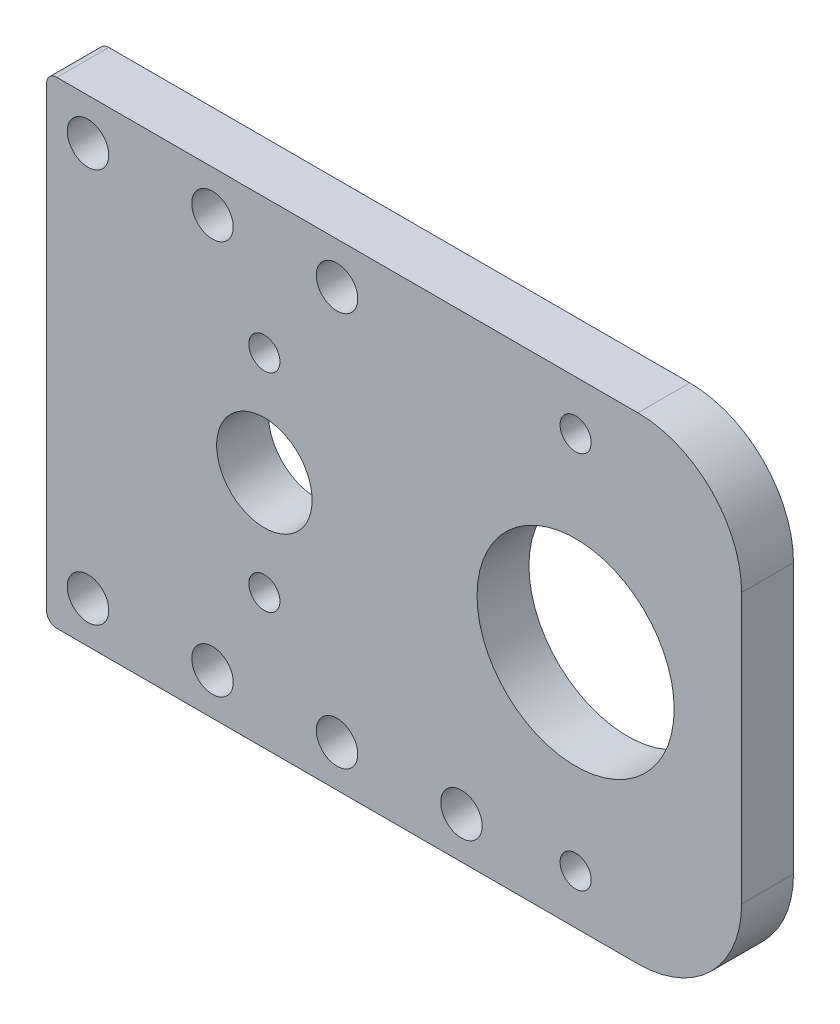
ISO-10303-21;
HEADER;
FILE_DESCRIPTION(('STEP AP214'),'2;1');
FILE_NAME('part.step','',(''),(''),'','','');
FILE_SCHEMA(('AUTOMOTIVE_DESIGN { 1 0 10303 214 1 1 1 1 }'));
ENDSEC;
DATA;
#1=APPLICATION_CONTEXT('core data for automotive mechanical design processes');
#2=APPLICATION_PROTOCOL_DEFINITION('international standard','automotive_design',2000,#1);
#3=PRODUCT_CONTEXT('',#1,'mechanical');
#4=PRODUCT('Part','Part','',(#3));
#5=PRODUCT_RELATED_PRODUCT_CATEGORY('part','',(#4));
#6=PRODUCT_DEFINITION_FORMATION('','',#4);
#7=PRODUCT_DEFINITION_CONTEXT('part definition',#1,'design');
#8=PRODUCT_DEFINITION('design','',#6,#7);
#9=PRODUCT_DEFINITION_SHAPE('','',#8);
#10=(LENGTH_UNIT() NAMED_UNIT(*) SI_UNIT(.MILLI.,.METRE.));
#11=(NAMED_UNIT(*) PLANE_ANGLE_UNIT() SI_UNIT($,.RADIAN.));
#12=(NAMED_UNIT(*) SI_UNIT($,.STERADIAN.) SOLID_ANGLE_UNIT());
#13=UNCERTAINTY_MEASURE_WITH_UNIT(LENGTH_MEASURE(1.E-05),#10,'distance_accuracy_value','');
#14=(GEOMETRIC_REPRESENTATION_CONTEXT(3) GLOBAL_UNCERTAINTY_ASSIGNED_CONTEXT((#13)) GLOBAL_UNIT_ASSIGNED_CONTEXT((#10,
#11,#12)) REPRESENTATION_CONTEXT('',''));
#15=CARTESIAN_POINT('',(0.,0.,0.));
#16=DIRECTION('',(0.,0.,1.));
#17=DIRECTION('',(1.,0.,0.));
#18=AXIS2_PLACEMENT_3D('',#15,#16,#17);
#19=CARTESIAN_POINT('',(0.,0.,5.));
#20=DIRECTION('',(0.,0.,1.));
#21=DIRECTION('',(1.,0.,0.));
#22=AXIS2_PLACEMENT_3D('',#19,#20,#21);
#23=PLANE('',#22);
#24=CARTESIAN_POINT('',(19.,-18.9999999999999,5.));
#25=DIRECTION('',(0.,0.,1.));
#26=DIRECTION('',(1.,0.,0.));
#27=AXIS2_PLACEMENT_3D('',#24,#25,#26);
#28=CIRCLE('',#27,2.);
#29=CARTESIAN_POINT('',(21.,-18.9999999999999,5.));
#30=VERTEX_POINT('',#29);
#31=EDGE_CURVE('E357',#30,#30,#28,.T.);
#32=ORIENTED_EDGE('',*,*,#31,.F.);
#33=EDGE_LOOP('',(#32));
#34=FACE_BOUND('',#33,.T.);
#35=CARTESIAN_POINT('',(7.00000000000001,18.9999999999999,5.));
#36=DIRECTION('',(0.,0.,1.));
#37=DIRECTION('',(1.,0.,0.));
#38=AXIS2_PLACEMENT_3D('',#35,#36,#37);
#39=CIRCLE('',#38,2.);
#40=CARTESIAN_POINT('',(9.00000000000001,18.9999999999999,5.));
#41=VERTEX_POINT('',#40);
#42=EDGE_CURVE('E183',#41,#41,#39,.F.);
#43=ORIENTED_EDGE('',*,*,#42,.T.);
#44=EDGE_LOOP('',(#43));
#45=FACE_BOUND('',#44,.T.);
#46=CARTESIAN_POINT('',(-4.99999999999999,-18.9999999999999,5.));
#47=DIRECTION('',(0.,0.,1.));
#48=DIRECTION('',(1.,0.,0.));
#49=AXIS2_PLACEMENT_3D('',#46,#47,#48);
#50=CIRCLE('',#49,2.);
#51=CARTESIAN_POINT('',(-2.99999999999999,-18.9999999999999,5.));
#52=VERTEX_POINT('',#51);
#53=EDGE_CURVE('E176',#52,#52,#50,.F.);
#54=ORIENTED_EDGE('',*,*,#53,.T.);
#55=EDGE_LOOP('',(#54));
#56=FACE_BOUND('',#55,.T.);
#57=CARTESIAN_POINT('',(-17.,-18.9999999999999,5.));
#58=DIRECTION('',(0.,0.,1.));
#59=DIRECTION('',(1.,0.,0.));
#60=AXIS2_PLACEMENT_3D('',#57,#58,#59);
#61=CIRCLE('',#60,2.);
#62=CARTESIAN_POINT('',(-15.,-18.9999999999999,5.));
#63=VERTEX_POINT('',#62);
#64=EDGE_CURVE('E179',#63,#63,#61,.F.);
#65=ORIENTED_EDGE('',*,*,#64,.T.);
#66=EDGE_LOOP('',(#65));
#67=FACE_BOUND('',#66,.T.);
#68=CARTESIAN_POINT('',(30.,18.25,5.));
#69=DIRECTION('',(0.,0.,1.));
#70=DIRECTION('',(1.,0.,0.));
#71=AXIS2_PLACEMENT_3D('',#68,#69,#70);
#72=CIRCLE('',#71,1.5);
#73=CARTESIAN_POINT('',(31.5,18.25,5.));
#74=VERTEX_POINT('',#73);
#75=EDGE_CURVE('E194',#74,#74,#72,.T.);
#76=ORIENTED_EDGE('',*,*,#75,.F.);
#77=EDGE_LOOP('',(#76));
#78=FACE_BOUND('',#77,.T.);
#79=CARTESIAN_POINT('',(0.,-9.99999999999999,5.));
#80=DIRECTION('',(0.,0.,1.));
#81=DIRECTION('',(1.,0.,0.));
#82=AXIS2_PLACEMENT_3D('',#79,#80,#81);
#83=CIRCLE('',#82,1.5);
#84=CARTESIAN_POINT('',(1.50000000000002,-9.99999999999999,5.));
#85=VERTEX_POINT('',#84);
#86=EDGE_CURVE('E197',#85,#85,#83,.T.);
#87=ORIENTED_EDGE('',*,*,#86,.F.);
#88=EDGE_LOOP('',(#87));
#89=FACE_BOUND('',#88,.T.);
#90=CARTESIAN_POINT('',(30.,-18.25,5.));
#91=DIRECTION('',(0.,0.,1.));
#92=DIRECTION('',(1.,0.,0.));
#93=AXIS2_PLACEMENT_3D('',#90,#91,#92);
#94=CIRCLE('',#93,1.5);
#95=CARTESIAN_POINT('',(31.5,-18.25,5.));
#96=VERTEX_POINT('',#95);
#97=EDGE_CURVE('E201',#96,#96,#94,.F.);
#98=ORIENTED_EDGE('',*,*,#97,.T.);
#99=EDGE_LOOP('',(#98));
#100=FACE_BOUND('',#99,.T.);
#101=CARTESIAN_POINT('',(30.,0.,5.));
#102=DIRECTION('',(0.,0.,1.));
#103=DIRECTION('',(1.,0.,0.));
#104=AXIS2_PLACEMENT_3D('',#101,#102,#103);
#105=CIRCLE('',#104,9.5);
#106=CARTESIAN_POINT('',(39.5,0.,5.));
#107=VERTEX_POINT('',#106);
#108=EDGE_CURVE('E204',#107,#107,#105,.T.);
#109=ORIENTED_EDGE('',*,*,#108,.F.);
#110=EDGE_LOOP('',(#109));
#111=FACE_BOUND('',#110,.T.);
#112=CARTESIAN_POINT('',(0.,0.,5.));
#113=DIRECTION('',(0.,0.,1.));
#114=DIRECTION('',(1.,0.,0.));
#115=AXIS2_PLACEMENT_3D('',#112,#113,#114);
#116=CIRCLE('',#115,4.6);
#117=CARTESIAN_POINT('',(4.6,0.,5.));
#118=VERTEX_POINT('',#117);
#119=EDGE_CURVE('E210',#118,#118,#116,.T.);
#120=ORIENTED_EDGE('',*,*,#119,.F.);
#121=EDGE_LOOP('',(#120));
#122=FACE_BOUND('',#121,.T.);
#123=CARTESIAN_POINT('',(0.,9.99999999999999,5.));
#124=DIRECTION('',(0.,0.,1.));
#125=DIRECTION('',(1.,0.,0.));
#126=AXIS2_PLACEMENT_3D('',#123,#124,#125);
#127=CIRCLE('',#126,1.5);
#128=CARTESIAN_POINT('',(1.50000000000002,9.99999999999999,5.));
#129=VERTEX_POINT('',#128);
#130=EDGE_CURVE('E114',#129,#129,#127,.F.);
#131=ORIENTED_EDGE('',*,*,#130,.T.);
#132=EDGE_LOOP('',(#131));
#133=FACE_BOUND('',#132,.T.);
#134=CARTESIAN_POINT('',(7.00000000000001,-18.9999999999999,5.));
#135=DIRECTION('',(0.,0.,1.));
#136=DIRECTION('',(1.,0.,0.));
#137=AXIS2_PLACEMENT_3D('',#134,#135,#136);
#138=CIRCLE('',#137,2.);
#139=CARTESIAN_POINT('',(9.00000000000001,-18.9999999999999,5.));
#140=VERTEX_POINT('',#139);
#141=EDGE_CURVE('E180',#140,#140,#138,.T.);
#142=ORIENTED_EDGE('',*,*,#141,.F.);
#143=EDGE_LOOP('',(#142));
#144=FACE_BOUND('',#143,.T.);
#145=CARTESIAN_POINT('',(-4.99999999999999,18.9999999999999,5.));
#146=DIRECTION('',(0.,0.,1.));
#147=DIRECTION('',(1.,0.,0.));
#148=AXIS2_PLACEMENT_3D('',#145,#146,#147);
#149=CIRCLE('',#148,2.);
#150=CARTESIAN_POINT('',(-2.99999999999999,18.9999999999999,5.));
#151=VERTEX_POINT('',#150);
#152=EDGE_CURVE('E186',#151,#151,#149,.T.);
#153=ORIENTED_EDGE('',*,*,#152,.F.);
#154=EDGE_LOOP('',(#153));
#155=FACE_BOUND('',#154,.T.);
#156=CARTESIAN_POINT('',(-17.,18.9999999999999,5.));
#157=DIRECTION('',(0.,0.,1.));
#158=DIRECTION('',(1.,0.,0.));
#159=AXIS2_PLACEMENT_3D('',#156,#157,#158);
#160=CIRCLE('',#159,2.);
#161=CARTESIAN_POINT('',(-15.,18.9999999999999,5.));
#162=VERTEX_POINT('',#161);
#163=EDGE_CURVE('E172',#162,#162,#160,.T.);
#164=ORIENTED_EDGE('',*,*,#163,.F.);
#165=EDGE_LOOP('',(#164));
#166=FACE_BOUND('',#165,.T.);
#167=DIRECTION('',(-1.,0.,0.));
#168=VECTOR('',#167,1.);
#169=CARTESIAN_POINT('',(0.,23.,5.));
#170=LINE('',#169,#168);
#171=CARTESIAN_POINT('',(36.,23.,5.));
#172=VERTEX_POINT('',#171);
#173=CARTESIAN_POINT('',(-20.,23.,5.));
#174=VERTEX_POINT('',#173);
#175=EDGE_CURVE('E167',#172,#174,#170,.T.);
#176=ORIENTED_EDGE('',*,*,#175,.T.);
#177=CARTESIAN_POINT('',(-20.,22.,5.));
#178=DIRECTION('',(0.,0.,1.));
#179=DIRECTION('',(1.,0.,0.));
#180=AXIS2_PLACEMENT_3D('',#177,#178,#179);
#181=CIRCLE('',#180,1.);
#182=CARTESIAN_POINT('',(-21.,22.,5.));
#183=VERTEX_POINT('',#182);
#184=EDGE_CURVE('E140',#174,#183,#181,.T.);
#185=ORIENTED_EDGE('',*,*,#184,.T.);
#186=DIRECTION('',(0.,-1.,0.));
#187=VECTOR('',#186,1.);
#188=CARTESIAN_POINT('',(-21.,0.,5.));
#189=LINE('',#188,#187);
#190=CARTESIAN_POINT('',(-21.,-22.,5.));
#191=VERTEX_POINT('',#190);
#192=EDGE_CURVE('E121',#183,#191,#189,.T.);
#193=ORIENTED_EDGE('',*,*,#192,.T.);
#194=CARTESIAN_POINT('',(-20.,-22.,5.));
#195=DIRECTION('',(0.,0.,1.));
#196=DIRECTION('',(1.,0.,0.));
#197=AXIS2_PLACEMENT_3D('',#194,#195,#196);
#198=CIRCLE('',#197,1.);
#199=CARTESIAN_POINT('',(-20.,-23.,5.));
#200=VERTEX_POINT('',#199);
#201=EDGE_CURVE('E138',#191,#200,#198,.T.);
#202=ORIENTED_EDGE('',*,*,#201,.T.);
#203=DIRECTION('',(-1.,0.,0.));
#204=VECTOR('',#203,1.);
#205=CARTESIAN_POINT('',(0.,-23.,5.));
#206=LINE('',#205,#204);
#207=CARTESIAN_POINT('',(36.,-23.,5.));
#208=VERTEX_POINT('',#207);
#209=EDGE_CURVE('E208',#208,#200,#206,.T.);
#210=ORIENTED_EDGE('',*,*,#209,.F.);
#211=CARTESIAN_POINT('',(36.,-13.,5.));
#212=DIRECTION('',(0.,0.,1.));
#213=DIRECTION('',(1.,0.,0.));
#214=AXIS2_PLACEMENT_3D('',#211,#212,#213);
#215=CIRCLE('',#214,10.);
#216=CARTESIAN_POINT('',(46.,-13.,5.));
#217=VERTEX_POINT('',#216);
#218=EDGE_CURVE('E250',#208,#217,#215,.T.);
#219=ORIENTED_EDGE('',*,*,#218,.T.);
#220=DIRECTION('',(0.,-1.,0.));
#221=VECTOR('',#220,1.);
#222=CARTESIAN_POINT('',(46.,0.,5.));
#223=LINE('',#222,#221);
#224=CARTESIAN_POINT('',(46.,13.,5.));
#225=VERTEX_POINT('',#224);
#226=EDGE_CURVE('E110',#225,#217,#223,.T.);
#227=ORIENTED_EDGE('',*,*,#226,.F.);
#228=CARTESIAN_POINT('',(36.,13.,5.));
#229=DIRECTION('',(0.,0.,1.));
#230=DIRECTION('',(1.,0.,0.));
#231=AXIS2_PLACEMENT_3D('',#228,#229,#230);
#232=CIRCLE('',#231,10.);
#233=EDGE_CURVE('E130',#225,#172,#232,.T.);
#234=ORIENTED_EDGE('',*,*,#233,.T.);
#235=EDGE_LOOP('',(#176,#185,#193,#202,#210,#219,#227,#234));
#236=FACE_BOUND('',#235,.T.);
#237=ADVANCED_FACE('F35',(#34,#45,#56,#67,#78,#89,#100,#111,#122,#133,#144,#155,#166,#236),#23,.T.);
#238=CARTESIAN_POINT('',(0.,0.,0.));
#239=DIRECTION('',(0.,0.,1.));
#240=DIRECTION('',(1.,0.,0.));
#241=AXIS2_PLACEMENT_3D('',#238,#239,#240);
#242=PLANE('',#241);
#243=CARTESIAN_POINT('',(19.,-18.9999999999999,0.));
#244=DIRECTION('',(0.,0.,1.));
#245=DIRECTION('',(1.,0.,0.));
#246=AXIS2_PLACEMENT_3D('',#243,#244,#245);
#247=CIRCLE('',#246,2.);
#248=CARTESIAN_POINT('',(21.,-18.9999999999999,0.));
#249=VERTEX_POINT('',#248);
#250=EDGE_CURVE('E39',#249,#249,#247,.T.);
#251=ORIENTED_EDGE('',*,*,#250,.T.);
#252=EDGE_LOOP('',(#251));
#253=FACE_BOUND('',#252,.T.);
#254=CARTESIAN_POINT('',(-17.,18.9999999999999,0.));
#255=DIRECTION('',(0.,0.,1.));
#256=DIRECTION('',(1.,0.,0.));
#257=AXIS2_PLACEMENT_3D('',#254,#255,#256);
#258=CIRCLE('',#257,2.);
#259=CARTESIAN_POINT('',(-15.,18.9999999999999,0.));
#260=VERTEX_POINT('',#259);
#261=EDGE_CURVE('E219',#260,#260,#258,.T.);
#262=ORIENTED_EDGE('',*,*,#261,.T.);
#263=EDGE_LOOP('',(#262));
#264=FACE_BOUND('',#263,.T.);
#265=CARTESIAN_POINT('',(7.00000000000001,-18.9999999999999,0.));
#266=DIRECTION('',(0.,0.,1.));
#267=DIRECTION('',(1.,0.,0.));
#268=AXIS2_PLACEMENT_3D('',#265,#266,#267);
#269=CIRCLE('',#268,2.);
#270=CARTESIAN_POINT('',(9.00000000000001,-18.9999999999999,0.));
#271=VERTEX_POINT('',#270);
#272=EDGE_CURVE('E238',#271,#271,#269,.T.);
#273=ORIENTED_EDGE('',*,*,#272,.T.);
#274=EDGE_LOOP('',(#273));
#275=FACE_BOUND('',#274,.T.);
#276=CARTESIAN_POINT('',(-4.99999999999999,-18.9999999999999,0.));
#277=DIRECTION('',(0.,0.,1.));
#278=DIRECTION('',(1.,0.,0.));
#279=AXIS2_PLACEMENT_3D('',#276,#277,#278);
#280=CIRCLE('',#279,2.);
#281=CARTESIAN_POINT('',(-2.99999999999999,-18.9999999999999,0.));
#282=VERTEX_POINT('',#281);
#283=EDGE_CURVE('E235',#282,#282,#280,.F.);
#284=ORIENTED_EDGE('',*,*,#283,.F.);
#285=EDGE_LOOP('',(#284));
#286=FACE_BOUND('',#285,.T.);
#287=CARTESIAN_POINT('',(-17.,-18.9999999999999,0.));
#288=DIRECTION('',(0.,0.,1.));
#289=DIRECTION('',(1.,0.,0.));
#290=AXIS2_PLACEMENT_3D('',#287,#288,#289);
#291=CIRCLE('',#290,2.);
#292=CARTESIAN_POINT('',(-15.,-18.9999999999999,0.));
#293=VERTEX_POINT('',#292);
#294=EDGE_CURVE('E193',#293,#293,#291,.F.);
#295=ORIENTED_EDGE('',*,*,#294,.F.);
#296=EDGE_LOOP('',(#295));
#297=FACE_BOUND('',#296,.T.);
#298=CARTESIAN_POINT('',(30.,18.25,0.));
#299=DIRECTION('',(0.,0.,1.));
#300=DIRECTION('',(1.,0.,0.));
#301=AXIS2_PLACEMENT_3D('',#298,#299,#300);
#302=CIRCLE('',#301,1.5);
#303=CARTESIAN_POINT('',(31.5,18.25,0.));
#304=VERTEX_POINT('',#303);
#305=EDGE_CURVE('E215',#304,#304,#302,.T.);
#306=ORIENTED_EDGE('',*,*,#305,.T.);
#307=EDGE_LOOP('',(#306));
#308=FACE_BOUND('',#307,.T.);
#309=CARTESIAN_POINT('',(0.,-9.99999999999999,0.));
#310=DIRECTION('',(0.,0.,1.));
#311=DIRECTION('',(1.,0.,0.));
#312=AXIS2_PLACEMENT_3D('',#309,#310,#311);
#313=CIRCLE('',#312,1.5);
#314=CARTESIAN_POINT('',(1.50000000000002,-9.99999999999999,0.));
#315=VERTEX_POINT('',#314);
#316=EDGE_CURVE('E218',#315,#315,#313,.T.);
#317=ORIENTED_EDGE('',*,*,#316,.T.);
#318=EDGE_LOOP('',(#317));
#319=FACE_BOUND('',#318,.T.);
#320=CARTESIAN_POINT('',(30.,-18.25,0.));
#321=DIRECTION('',(0.,0.,1.));
#322=DIRECTION('',(1.,0.,0.));
#323=AXIS2_PLACEMENT_3D('',#320,#321,#322);
#324=CIRCLE('',#323,1.5);
#325=CARTESIAN_POINT('',(31.5,-18.25,0.));
#326=VERTEX_POINT('',#325);
#327=EDGE_CURVE('E222',#326,#326,#324,.F.);
#328=ORIENTED_EDGE('',*,*,#327,.F.);
#329=EDGE_LOOP('',(#328));
#330=FACE_BOUND('',#329,.T.);
#331=CARTESIAN_POINT('',(30.,0.,0.));
#332=DIRECTION('',(0.,0.,1.));
#333=DIRECTION('',(1.,0.,0.));
#334=AXIS2_PLACEMENT_3D('',#331,#332,#333);
#335=CIRCLE('',#334,9.5);
#336=CARTESIAN_POINT('',(39.5,0.,0.));
#337=VERTEX_POINT('',#336);
#338=EDGE_CURVE('E161',#337,#337,#335,.T.);
#339=ORIENTED_EDGE('',*,*,#338,.T.);
#340=EDGE_LOOP('',(#339));
#341=FACE_BOUND('',#340,.T.);
#342=CARTESIAN_POINT('',(0.,0.,0.));
#343=DIRECTION('',(0.,0.,1.));
#344=DIRECTION('',(1.,0.,0.));
#345=AXIS2_PLACEMENT_3D('',#342,#343,#344);
#346=CIRCLE('',#345,4.6);
#347=CARTESIAN_POINT('',(4.6,0.,0.));
#348=VERTEX_POINT('',#347);
#349=EDGE_CURVE('E228',#348,#348,#346,.T.);
#350=ORIENTED_EDGE('',*,*,#349,.T.);
#351=EDGE_LOOP('',(#350));
#352=FACE_BOUND('',#351,.T.);
#353=CARTESIAN_POINT('',(0.,9.99999999999999,0.));
#354=DIRECTION('',(0.,0.,1.));
#355=DIRECTION('',(1.,0.,0.));
#356=AXIS2_PLACEMENT_3D('',#353,#354,#355);
#357=CIRCLE('',#356,1.5);
#358=CARTESIAN_POINT('',(1.50000000000002,9.99999999999999,0.));
#359=VERTEX_POINT('',#358);
#360=EDGE_CURVE('E198',#359,#359,#357,.F.);
#361=ORIENTED_EDGE('',*,*,#360,.F.);
#362=EDGE_LOOP('',(#361));
#363=FACE_BOUND('',#362,.T.);
#364=CARTESIAN_POINT('',(7.00000000000001,18.9999999999999,0.));
#365=DIRECTION('',(0.,0.,1.));
#366=DIRECTION('',(1.,0.,0.));
#367=AXIS2_PLACEMENT_3D('',#364,#365,#366);
#368=CIRCLE('',#367,2.);
#369=CARTESIAN_POINT('',(9.00000000000001,18.9999999999999,0.));
#370=VERTEX_POINT('',#369);
#371=EDGE_CURVE('E241',#370,#370,#368,.F.);
#372=ORIENTED_EDGE('',*,*,#371,.F.);
#373=EDGE_LOOP('',(#372));
#374=FACE_BOUND('',#373,.T.);
#375=CARTESIAN_POINT('',(-4.99999999999999,18.9999999999999,0.));
#376=DIRECTION('',(0.,0.,1.));
#377=DIRECTION('',(1.,0.,0.));
#378=AXIS2_PLACEMENT_3D('',#375,#376,#377);
#379=CIRCLE('',#378,2.);
#380=CARTESIAN_POINT('',(-2.99999999999999,18.9999999999999,0.));
#381=VERTEX_POINT('',#380);
#382=EDGE_CURVE('E244',#381,#381,#379,.T.);
#383=ORIENTED_EDGE('',*,*,#382,.T.);
#384=EDGE_LOOP('',(#383));
#385=FACE_BOUND('',#384,.T.);
#386=DIRECTION('',(0.,-1.,0.));
#387=VECTOR('',#386,1.);
#388=CARTESIAN_POINT('',(-21.,0.,0.));
#389=LINE('',#388,#387);
#390=CARTESIAN_POINT('',(-21.,22.,0.));
#391=VERTEX_POINT('',#390);
#392=CARTESIAN_POINT('',(-21.,-22.,0.));
#393=VERTEX_POINT('',#392);
#394=EDGE_CURVE('E151',#391,#393,#389,.T.);
#395=ORIENTED_EDGE('',*,*,#394,.F.);
#396=CARTESIAN_POINT('',(-20.,22.,0.));
#397=DIRECTION('',(0.,0.,1.));
#398=DIRECTION('',(1.,0.,0.));
#399=AXIS2_PLACEMENT_3D('',#396,#397,#398);
#400=CIRCLE('',#399,1.);
#401=CARTESIAN_POINT('',(-20.,23.,0.));
#402=VERTEX_POINT('',#401);
#403=EDGE_CURVE('E44',#391,#402,#400,.F.);
#404=ORIENTED_EDGE('',*,*,#403,.T.);
#405=DIRECTION('',(-1.,0.,0.));
#406=VECTOR('',#405,1.);
#407=CARTESIAN_POINT('',(0.,23.,0.));
#408=LINE('',#407,#406);
#409=CARTESIAN_POINT('',(36.,23.,0.));
#410=VERTEX_POINT('',#409);
#411=EDGE_CURVE('E150',#410,#402,#408,.T.);
#412=ORIENTED_EDGE('',*,*,#411,.F.);
#413=CARTESIAN_POINT('',(36.,13.,0.));
#414=DIRECTION('',(0.,0.,1.));
#415=DIRECTION('',(1.,0.,0.));
#416=AXIS2_PLACEMENT_3D('',#413,#414,#415);
#417=CIRCLE('',#416,10.);
#418=CARTESIAN_POINT('',(46.,13.,0.));
#419=VERTEX_POINT('',#418);
#420=EDGE_CURVE('E120',#410,#419,#417,.F.);
#421=ORIENTED_EDGE('',*,*,#420,.T.);
#422=DIRECTION('',(0.,1.,0.));
#423=VECTOR('',#422,1.);
#424=CARTESIAN_POINT('',(46.,0.,0.));
#425=LINE('',#424,#423);
#426=CARTESIAN_POINT('',(46.,-13.,0.));
#427=VERTEX_POINT('',#426);
#428=EDGE_CURVE('E107',#427,#419,#425,.T.);
#429=ORIENTED_EDGE('',*,*,#428,.F.);
#430=CARTESIAN_POINT('',(36.,-13.,0.));
#431=DIRECTION('',(0.,0.,1.));
#432=DIRECTION('',(1.,0.,0.));
#433=AXIS2_PLACEMENT_3D('',#430,#431,#432);
#434=CIRCLE('',#433,10.);
#435=CARTESIAN_POINT('',(36.,-23.,0.));
#436=VERTEX_POINT('',#435);
#437=EDGE_CURVE('E117',#427,#436,#434,.F.);
#438=ORIENTED_EDGE('',*,*,#437,.T.);
#439=DIRECTION('',(-1.,0.,0.));
#440=VECTOR('',#439,1.);
#441=CARTESIAN_POINT('',(0.,-23.,0.));
#442=LINE('',#441,#440);
#443=CARTESIAN_POINT('',(-20.,-23.,0.));
#444=VERTEX_POINT('',#443);
#445=EDGE_CURVE('E160',#436,#444,#442,.T.);
#446=ORIENTED_EDGE('',*,*,#445,.T.);
#447=CARTESIAN_POINT('',(-20.,-22.,0.));
#448=DIRECTION('',(0.,0.,1.));
#449=DIRECTION('',(1.,0.,0.));
#450=AXIS2_PLACEMENT_3D('',#447,#448,#449);
#451=CIRCLE('',#450,1.);
#452=EDGE_CURVE('E56',#444,#393,#451,.F.);
#453=ORIENTED_EDGE('',*,*,#452,.T.);
#454=EDGE_LOOP('',(#395,#404,#412,#421,#429,#438,#446,#453));
#455=FACE_BOUND('',#454,.T.);
#456=ADVANCED_FACE('F116',(#253,#264,#275,#286,#297,#308,#319,#330,#341,#352,#363,#374,#385,
#455),#242,.F.);
#457=CARTESIAN_POINT('',(0.,23.,5.));
#458=DIRECTION('',(0.,-1.,0.));
#459=DIRECTION('',(1.,0.,0.));
#460=AXIS2_PLACEMENT_3D('',#457,#458,#459);
#461=PLANE('',#460);
#462=ORIENTED_EDGE('',*,*,#411,.T.);
#463=DIRECTION('',(0.,0.,1.));
#464=VECTOR('',#463,1.);
#465=CARTESIAN_POINT('',(-20.,23.,5.));
#466=LINE('',#465,#464);
#467=EDGE_CURVE('E135',#402,#174,#466,.T.);
#468=ORIENTED_EDGE('',*,*,#467,.T.);
#469=ORIENTED_EDGE('',*,*,#175,.F.);
#470=DIRECTION('',(0.,0.,1.));
#471=VECTOR('',#470,1.);
#472=CARTESIAN_POINT('',(36.,23.,5.));
#473=LINE('',#472,#471);
#474=EDGE_CURVE('E127',#172,#410,#473,.F.);
#475=ORIENTED_EDGE('',*,*,#474,.T.);
#476=EDGE_LOOP('',(#462,#468,#469,#475));
#477=FACE_BOUND('',#476,.T.);
#478=ADVANCED_FACE('F156',(#477),#461,.F.);
#479=CARTESIAN_POINT('',(0.,-23.,5.));
#480=DIRECTION('',(0.,-1.,0.));
#481=DIRECTION('',(1.,0.,0.));
#482=AXIS2_PLACEMENT_3D('',#479,#480,#481);
#483=PLANE('',#482);
#484=ORIENTED_EDGE('',*,*,#209,.T.);
#485=DIRECTION('',(0.,0.,1.));
#486=VECTOR('',#485,1.);
#487=CARTESIAN_POINT('',(-20.,-23.,5.));
#488=LINE('',#487,#486);
#489=EDGE_CURVE('E11',#200,#444,#488,.F.);
#490=ORIENTED_EDGE('',*,*,#489,.T.);
#491=ORIENTED_EDGE('',*,*,#445,.F.);
#492=DIRECTION('',(0.,0.,1.));
#493=VECTOR('',#492,1.);
#494=CARTESIAN_POINT('',(36.,-23.,5.));
#495=LINE('',#494,#493);
#496=EDGE_CURVE('E126',#436,#208,#495,.T.);
#497=ORIENTED_EDGE('',*,*,#496,.T.);
#498=EDGE_LOOP('',(#484,#490,#491,#497));
#499=FACE_BOUND('',#498,.T.);
#500=ADVANCED_FACE('F285',(#499),#483,.T.);
#501=CARTESIAN_POINT('',(0.,0.,5.));
#502=DIRECTION('',(0.,0.,-1.));
#503=DIRECTION('',(-1.,0.,0.));
#504=AXIS2_PLACEMENT_3D('',#501,#502,#503);
#505=CYLINDRICAL_SURFACE('',#504,4.6);
#506=ORIENTED_EDGE('',*,*,#119,.T.);
#507=EDGE_LOOP('',(#506));
#508=FACE_BOUND('',#507,.T.);
#509=ORIENTED_EDGE('',*,*,#349,.F.);
#510=EDGE_LOOP('',(#509));
#511=FACE_BOUND('',#510,.T.);
#512=ADVANCED_FACE('F281',(#508,#511),#505,.F.);
#513=CARTESIAN_POINT('',(30.,0.,5.));
#514=DIRECTION('',(0.,0.,-1.));
#515=DIRECTION('',(-1.,0.,0.));
#516=AXIS2_PLACEMENT_3D('',#513,#514,#515);
#517=CYLINDRICAL_SURFACE('',#516,9.5);
#518=ORIENTED_EDGE('',*,*,#108,.T.);
#519=EDGE_LOOP('',(#518));
#520=FACE_BOUND('',#519,.T.);
#521=ORIENTED_EDGE('',*,*,#338,.F.);
#522=EDGE_LOOP('',(#521));
#523=FACE_BOUND('',#522,.T.);
#524=ADVANCED_FACE('F284',(#520,#523),#517,.F.);
#525=CARTESIAN_POINT('',(30.,-18.25,5.));
#526=DIRECTION('',(0.,0.,-1.));
#527=DIRECTION('',(-1.,0.,0.));
#528=AXIS2_PLACEMENT_3D('',#525,#526,#527);
#529=CYLINDRICAL_SURFACE('',#528,1.5);
#530=ORIENTED_EDGE('',*,*,#97,.F.);
#531=EDGE_LOOP('',(#530));
#532=FACE_BOUND('',#531,.T.);
#533=ORIENTED_EDGE('',*,*,#327,.T.);
#534=EDGE_LOOP('',(#533));
#535=FACE_BOUND('',#534,.T.);
#536=ADVANCED_FACE('F293',(#532,#535),#529,.F.);
#537=CARTESIAN_POINT('',(0.,-9.99999999999999,5.));
#538=DIRECTION('',(0.,0.,-1.));
#539=DIRECTION('',(-1.,0.,0.));
#540=AXIS2_PLACEMENT_3D('',#537,#538,#539);
#541=CYLINDRICAL_SURFACE('',#540,1.5);
#542=ORIENTED_EDGE('',*,*,#86,.T.);
#543=EDGE_LOOP('',(#542));
#544=FACE_BOUND('',#543,.T.);
#545=ORIENTED_EDGE('',*,*,#316,.F.);
#546=EDGE_LOOP('',(#545));
#547=FACE_BOUND('',#546,.T.);
#548=ADVANCED_FACE('F297',(#544,#547),#541,.F.);
#549=CARTESIAN_POINT('',(30.,18.25,5.));
#550=DIRECTION('',(0.,0.,-1.));
#551=DIRECTION('',(-1.,0.,0.));
#552=AXIS2_PLACEMENT_3D('',#549,#550,#551);
#553=CYLINDRICAL_SURFACE('',#552,1.5);
#554=ORIENTED_EDGE('',*,*,#75,.T.);
#555=EDGE_LOOP('',(#554));
#556=FACE_BOUND('',#555,.T.);
#557=ORIENTED_EDGE('',*,*,#305,.F.);
#558=EDGE_LOOP('',(#557));
#559=FACE_BOUND('',#558,.T.);
#560=ADVANCED_FACE('F279',(#556,#559),#553,.F.);
#561=CARTESIAN_POINT('',(0.,9.99999999999999,5.));
#562=DIRECTION('',(0.,0.,-1.));
#563=DIRECTION('',(-1.,0.,0.));
#564=AXIS2_PLACEMENT_3D('',#561,#562,#563);
#565=CYLINDRICAL_SURFACE('',#564,1.5);
#566=ORIENTED_EDGE('',*,*,#130,.F.);
#567=EDGE_LOOP('',(#566));
#568=FACE_BOUND('',#567,.T.);
#569=ORIENTED_EDGE('',*,*,#360,.T.);
#570=EDGE_LOOP('',(#569));
#571=FACE_BOUND('',#570,.T.);
#572=ADVANCED_FACE('F276',(#568,#571),#565,.F.);
#573=CARTESIAN_POINT('',(-17.,-18.9999999999999,-5.));
#574=DIRECTION('',(0.,0.,1.));
#575=DIRECTION('',(1.,0.,0.));
#576=AXIS2_PLACEMENT_3D('',#573,#574,#575);
#577=CYLINDRICAL_SURFACE('',#576,2.);
#578=ORIENTED_EDGE('',*,*,#64,.F.);
#579=EDGE_LOOP('',(#578));
#580=FACE_BOUND('',#579,.T.);
#581=ORIENTED_EDGE('',*,*,#294,.T.);
#582=EDGE_LOOP('',(#581));
#583=FACE_BOUND('',#582,.T.);
#584=ADVANCED_FACE('F273',(#580,#583),#577,.F.);
#585=CARTESIAN_POINT('',(-4.99999999999999,-18.9999999999999,-5.));
#586=DIRECTION('',(0.,0.,1.));
#587=DIRECTION('',(1.,0.,0.));
#588=AXIS2_PLACEMENT_3D('',#585,#586,#587);
#589=CYLINDRICAL_SURFACE('',#588,2.);
#590=ORIENTED_EDGE('',*,*,#53,.F.);
#591=EDGE_LOOP('',(#590));
#592=FACE_BOUND('',#591,.T.);
#593=ORIENTED_EDGE('',*,*,#283,.T.);
#594=EDGE_LOOP('',(#593));
#595=FACE_BOUND('',#594,.T.);
#596=ADVANCED_FACE('F341',(#592,#595),#589,.F.);
#597=CARTESIAN_POINT('',(7.00000000000001,-18.9999999999999,-5.));
#598=DIRECTION('',(0.,0.,1.));
#599=DIRECTION('',(1.,0.,0.));
#600=AXIS2_PLACEMENT_3D('',#597,#598,#599);
#601=CYLINDRICAL_SURFACE('',#600,2.);
#602=ORIENTED_EDGE('',*,*,#141,.T.);
#603=EDGE_LOOP('',(#602));
#604=FACE_BOUND('',#603,.T.);
#605=ORIENTED_EDGE('',*,*,#272,.F.);
#606=EDGE_LOOP('',(#605));
#607=FACE_BOUND('',#606,.T.);
#608=ADVANCED_FACE('F335',(#604,#607),#601,.F.);
#609=CARTESIAN_POINT('',(7.00000000000001,18.9999999999999,-5.));
#610=DIRECTION('',(0.,0.,1.));
#611=DIRECTION('',(1.,0.,0.));
#612=AXIS2_PLACEMENT_3D('',#609,#610,#611);
#613=CYLINDRICAL_SURFACE('',#612,2.);
#614=ORIENTED_EDGE('',*,*,#42,.F.);
#615=EDGE_LOOP('',(#614));
#616=FACE_BOUND('',#615,.T.);
#617=ORIENTED_EDGE('',*,*,#371,.T.);
#618=EDGE_LOOP('',(#617));
#619=FACE_BOUND('',#618,.T.);
#620=ADVANCED_FACE('F327',(#616,#619),#613,.F.);
#621=CARTESIAN_POINT('',(-4.99999999999999,18.9999999999999,-5.));
#622=DIRECTION('',(0.,0.,1.));
#623=DIRECTION('',(1.,0.,0.));
#624=AXIS2_PLACEMENT_3D('',#621,#622,#623);
#625=CYLINDRICAL_SURFACE('',#624,2.);
#626=ORIENTED_EDGE('',*,*,#152,.T.);
#627=EDGE_LOOP('',(#626));
#628=FACE_BOUND('',#627,.T.);
#629=ORIENTED_EDGE('',*,*,#382,.F.);
#630=EDGE_LOOP('',(#629));
#631=FACE_BOUND('',#630,.T.);
#632=ADVANCED_FACE('F324',(#628,#631),#625,.F.);
#633=CARTESIAN_POINT('',(-17.,18.9999999999999,-5.));
#634=DIRECTION('',(0.,0.,1.));
#635=DIRECTION('',(1.,0.,0.));
#636=AXIS2_PLACEMENT_3D('',#633,#634,#635);
#637=CYLINDRICAL_SURFACE('',#636,2.);
#638=ORIENTED_EDGE('',*,*,#163,.T.);
#639=EDGE_LOOP('',(#638));
#640=FACE_BOUND('',#639,.T.);
#641=ORIENTED_EDGE('',*,*,#261,.F.);
#642=EDGE_LOOP('',(#641));
#643=FACE_BOUND('',#642,.T.);
#644=ADVANCED_FACE('F326',(#640,#643),#637,.F.);
#645=CARTESIAN_POINT('',(-21.,0.,0.));
#646=DIRECTION('',(-1.,0.,0.));
#647=DIRECTION('',(0.,-1.,0.));
#648=AXIS2_PLACEMENT_3D('',#645,#646,#647);
#649=PLANE('',#648);
#650=ORIENTED_EDGE('',*,*,#192,.F.);
#651=DIRECTION('',(0.,0.,1.));
#652=VECTOR('',#651,1.);
#653=CARTESIAN_POINT('',(-21.,22.,0.));
#654=LINE('',#653,#652);
#655=EDGE_CURVE('E145',#183,#391,#654,.F.);
#656=ORIENTED_EDGE('',*,*,#655,.T.);
#657=ORIENTED_EDGE('',*,*,#394,.T.);
#658=DIRECTION('',(0.,0.,1.));
#659=VECTOR('',#658,1.);
#660=CARTESIAN_POINT('',(-21.,-22.,0.));
#661=LINE('',#660,#659);
#662=EDGE_CURVE('E142',#393,#191,#661,.T.);
#663=ORIENTED_EDGE('',*,*,#662,.T.);
#664=EDGE_LOOP('',(#650,#656,#657,#663));
#665=FACE_BOUND('',#664,.T.);
#666=ADVANCED_FACE('F169',(#665),#649,.T.);
#667=CARTESIAN_POINT('',(46.,0.,-46.3896540189728));
#668=DIRECTION('',(-1.,0.,0.));
#669=DIRECTION('',(0.,0.,1.));
#670=AXIS2_PLACEMENT_3D('',#667,#668,#669);
#671=PLANE('',#670);
#672=ORIENTED_EDGE('',*,*,#428,.T.);
#673=DIRECTION('',(0.,0.,1.));
#674=VECTOR('',#673,1.);
#675=CARTESIAN_POINT('',(46.,13.,-46.3896540189728));
#676=LINE('',#675,#674);
#677=EDGE_CURVE('E113',#419,#225,#676,.T.);
#678=ORIENTED_EDGE('',*,*,#677,.T.);
#679=ORIENTED_EDGE('',*,*,#226,.T.);
#680=DIRECTION('',(0.,0.,1.));
#681=VECTOR('',#680,1.);
#682=CARTESIAN_POINT('',(46.,-13.,0.));
#683=LINE('',#682,#681);
#684=EDGE_CURVE('E103',#217,#427,#683,.F.);
#685=ORIENTED_EDGE('',*,*,#684,.T.);
#686=EDGE_LOOP('',(#672,#678,#679,#685));
#687=FACE_BOUND('',#686,.T.);
#688=ADVANCED_FACE('F105',(#687),#671,.F.);
#689=CARTESIAN_POINT('',(36.,13.,-46.3896540189728));
#690=DIRECTION('',(0.,0.,1.));
#691=DIRECTION('',(1.,0.,0.));
#692=AXIS2_PLACEMENT_3D('',#689,#690,#691);
#693=CYLINDRICAL_SURFACE('',#692,10.);
#694=ORIENTED_EDGE('',*,*,#420,.F.);
#695=ORIENTED_EDGE('',*,*,#474,.F.);
#696=ORIENTED_EDGE('',*,*,#233,.F.);
#697=ORIENTED_EDGE('',*,*,#677,.F.);
#698=EDGE_LOOP('',(#694,#695,#696,#697));
#699=FACE_BOUND('',#698,.T.);
#700=ADVANCED_FACE('F252',(#699),#693,.T.);
#701=CARTESIAN_POINT('',(36.,-13.,5.));
#702=DIRECTION('',(0.,0.,-1.));
#703=DIRECTION('',(-1.,0.,0.));
#704=AXIS2_PLACEMENT_3D('',#701,#702,#703);
#705=CYLINDRICAL_SURFACE('',#704,10.);
#706=ORIENTED_EDGE('',*,*,#437,.F.);
#707=ORIENTED_EDGE('',*,*,#684,.F.);
#708=ORIENTED_EDGE('',*,*,#218,.F.);
#709=ORIENTED_EDGE('',*,*,#496,.F.);
#710=EDGE_LOOP('',(#706,#707,#708,#709));
#711=FACE_BOUND('',#710,.T.);
#712=ADVANCED_FACE('F124',(#711),#705,.T.);
#713=CARTESIAN_POINT('',(-20.,22.,5.));
#714=DIRECTION('',(0.,0.,-1.));
#715=DIRECTION('',(-1.,0.,0.));
#716=AXIS2_PLACEMENT_3D('',#713,#714,#715);
#717=CYLINDRICAL_SURFACE('',#716,1.);
#718=ORIENTED_EDGE('',*,*,#403,.F.);
#719=ORIENTED_EDGE('',*,*,#655,.F.);
#720=ORIENTED_EDGE('',*,*,#184,.F.);
#721=ORIENTED_EDGE('',*,*,#467,.F.);
#722=EDGE_LOOP('',(#718,#719,#720,#721));
#723=FACE_BOUND('',#722,.T.);
#724=ADVANCED_FACE('F163',(#723),#717,.T.);
#725=CARTESIAN_POINT('',(-20.,-22.,0.));
#726=DIRECTION('',(0.,0.,1.));
#727=DIRECTION('',(1.,0.,0.));
#728=AXIS2_PLACEMENT_3D('',#725,#726,#727);
#729=CYLINDRICAL_SURFACE('',#728,1.);
#730=ORIENTED_EDGE('',*,*,#452,.F.);
#731=ORIENTED_EDGE('',*,*,#489,.F.);
#732=ORIENTED_EDGE('',*,*,#201,.F.);
#733=ORIENTED_EDGE('',*,*,#662,.F.);
#734=EDGE_LOOP('',(#730,#731,#732,#733));
#735=FACE_BOUND('',#734,.T.);
#736=ADVANCED_FACE('F37',(#735),#729,.T.);
#737=CARTESIAN_POINT('',(19.,-18.9999999999999,-5.));
#738=DIRECTION('',(0.,0.,1.));
#739=DIRECTION('',(1.,0.,0.));
#740=AXIS2_PLACEMENT_3D('',#737,#738,#739);
#741=CYLINDRICAL_SURFACE('',#740,2.);
#742=ORIENTED_EDGE('',*,*,#31,.T.);
#743=EDGE_LOOP('',(#742));
#744=FACE_BOUND('',#743,.T.);
#745=ORIENTED_EDGE('',*,*,#250,.F.);
#746=EDGE_LOOP('',(#745));
#747=FACE_BOUND('',#746,.T.);
#748=ADVANCED_FACE('F348',(#744,#747),#741,.F.);
#749=CLOSED_SHELL('',(#237,#456,#478,#500,#512,#524,#536,#548,#560,#572,#584,#596,#608,#620,
#632,#644,#666,#688,#700,#712,#724,#736,#748));
#750=MANIFOLD_SOLID_BREP('B2',#749);
#751=ADVANCED_BREP_SHAPE_REPRESENTATION('',(#18,#750),#14);
#752=SHAPE_DEFINITION_REPRESENTATION(#9,#751);
ENDSEC;
END-ISO-10303-21;
